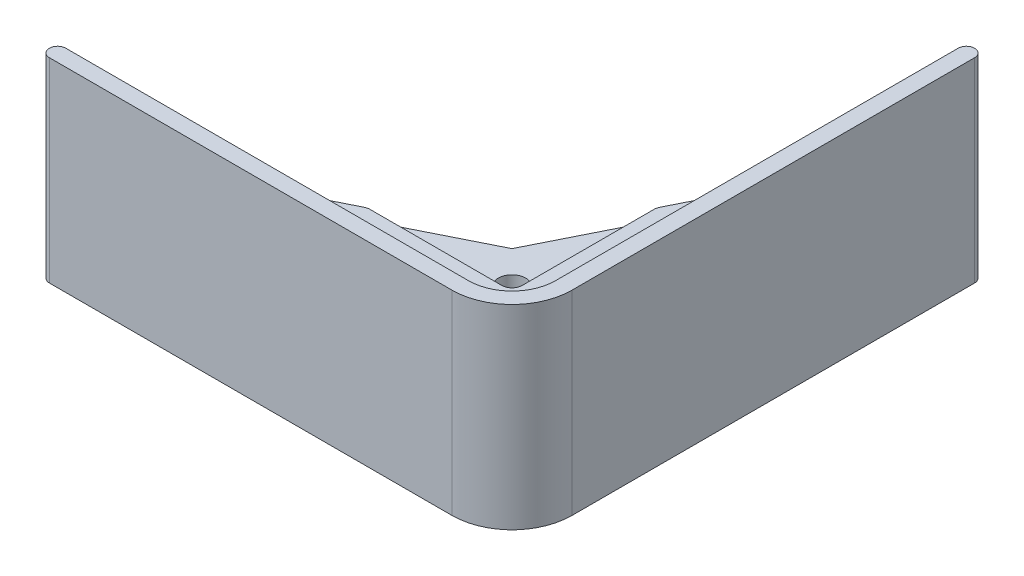
ISO-10303-21;
HEADER;
FILE_DESCRIPTION(('STEP AP214'),'2;1');
FILE_NAME('part.step','',(''),(''),'','','');
FILE_SCHEMA(('AUTOMOTIVE_DESIGN { 1 0 10303 214 1 1 1 1 }'));
ENDSEC;
DATA;
#1=APPLICATION_CONTEXT('core data for automotive mechanical design processes');
#2=APPLICATION_PROTOCOL_DEFINITION('international standard','automotive_design',2000,#1);
#3=PRODUCT_CONTEXT('',#1,'mechanical');
#4=PRODUCT('Part','Part','',(#3));
#5=PRODUCT_RELATED_PRODUCT_CATEGORY('part','',(#4));
#6=PRODUCT_DEFINITION_FORMATION('','',#4);
#7=PRODUCT_DEFINITION_CONTEXT('part definition',#1,'design');
#8=PRODUCT_DEFINITION('design','',#6,#7);
#9=PRODUCT_DEFINITION_SHAPE('','',#8);
#10=(LENGTH_UNIT() NAMED_UNIT(*) SI_UNIT(.MILLI.,.METRE.));
#11=(NAMED_UNIT(*) PLANE_ANGLE_UNIT() SI_UNIT($,.RADIAN.));
#12=(NAMED_UNIT(*) SI_UNIT($,.STERADIAN.) SOLID_ANGLE_UNIT());
#13=UNCERTAINTY_MEASURE_WITH_UNIT(LENGTH_MEASURE(1.E-05),#10,'distance_accuracy_value','');
#14=(GEOMETRIC_REPRESENTATION_CONTEXT(3) GLOBAL_UNCERTAINTY_ASSIGNED_CONTEXT((#13)) GLOBAL_UNIT_ASSIGNED_CONTEXT((#10,
#11,#12)) REPRESENTATION_CONTEXT('',''));
#15=CARTESIAN_POINT('',(0.,0.,0.));
#16=DIRECTION('',(0.,0.,1.));
#17=DIRECTION('',(1.,0.,0.));
#18=AXIS2_PLACEMENT_3D('',#15,#16,#17);
#19=CARTESIAN_POINT('',(0.,50.8,0.));
#20=DIRECTION('',(0.,-1.,0.));
#21=DIRECTION('',(0.,0.,-1.));
#22=AXIS2_PLACEMENT_3D('',#19,#20,#21);
#23=CYLINDRICAL_SURFACE('',#22,4.28625);
#24=CARTESIAN_POINT('',(0.,0.,0.));
#25=DIRECTION('',(0.,1.,0.));
#26=DIRECTION('',(0.,0.,1.));
#27=AXIS2_PLACEMENT_3D('',#24,#25,#26);
#28=CIRCLE('',#27,4.28625);
#29=CARTESIAN_POINT('',(0.,0.,4.28625));
#30=VERTEX_POINT('',#29);
#31=EDGE_CURVE('E273',#30,#30,#28,.T.);
#32=ORIENTED_EDGE('',*,*,#31,.F.);
#33=EDGE_LOOP('',(#32));
#34=FACE_BOUND('',#33,.T.);
#35=CARTESIAN_POINT('',(0.,47.371,0.));
#36=DIRECTION('',(0.,1.,0.));
#37=DIRECTION('',(0.,0.,1.));
#38=AXIS2_PLACEMENT_3D('',#35,#36,#37);
#39=CIRCLE('',#38,4.28625);
#40=CARTESIAN_POINT('',(0.,47.371,4.28625));
#41=VERTEX_POINT('',#40);
#42=EDGE_CURVE('E259',#41,#41,#39,.T.);
#43=ORIENTED_EDGE('',*,*,#42,.T.);
#44=EDGE_LOOP('',(#43));
#45=FACE_BOUND('',#44,.T.);
#46=ADVANCED_FACE('F39',(#34,#45),#23,.F.);
#47=CARTESIAN_POINT('',(-12.0476063758865,50.8,-6.00671496008418));
#48=DIRECTION('',(-0.894934361602028,0.,-0.446197813109804));
#49=DIRECTION('',(-0.446197813109804,0.,0.894934361602028));
#50=AXIS2_PLACEMENT_3D('',#47,#48,#49);
#51=PLANE('',#50);
#52=DIRECTION('',(0.446197813109804,0.,-0.894934361602028));
#53=VECTOR('',#52,1.);
#54=CARTESIAN_POINT('',(-12.0476063758865,47.371,-6.00671496008418));
#55=LINE('',#54,#53);
#56=CARTESIAN_POINT('',(-10.0377876646592,47.371,-10.0377876646592));
#57=VERTEX_POINT('',#56);
#58=CARTESIAN_POINT('',(5.15958340191356,47.371,-40.5189984054781));
#59=VERTEX_POINT('',#58);
#60=EDGE_CURVE('E266',#57,#59,#55,.T.);
#61=ORIENTED_EDGE('',*,*,#60,.T.);
#62=DIRECTION('',(0.,1.,0.));
#63=VECTOR('',#62,1.);
#64=CARTESIAN_POINT('',(5.15958340191356,50.8,-40.5189984054781));
#65=LINE('',#64,#63);
#66=CARTESIAN_POINT('',(5.15958340191356,50.8,-40.5189984054781));
#67=VERTEX_POINT('',#66);
#68=EDGE_CURVE('E297',#59,#67,#65,.T.);
#69=ORIENTED_EDGE('',*,*,#68,.T.);
#70=DIRECTION('',(0.446197813109804,0.,-0.894934361602028));
#71=VECTOR('',#70,1.);
#72=CARTESIAN_POINT('',(-12.0476063758865,50.8,-6.00671496008418));
#73=LINE('',#72,#71);
#74=CARTESIAN_POINT('',(13.462,50.8,-57.1710699299391));
#75=VERTEX_POINT('',#74);
#76=EDGE_CURVE('E269',#67,#75,#73,.T.);
#77=ORIENTED_EDGE('',*,*,#76,.T.);
#78=DIRECTION('',(0.,-1.,0.));
#79=VECTOR('',#78,1.);
#80=CARTESIAN_POINT('',(13.462,50.8,-57.1710699299391));
#81=LINE('',#80,#79);
#82=CARTESIAN_POINT('',(13.462,0.,-57.1710699299391));
#83=VERTEX_POINT('',#82);
#84=EDGE_CURVE('E275',#75,#83,#81,.T.);
#85=ORIENTED_EDGE('',*,*,#84,.T.);
#86=DIRECTION('',(0.446197813109804,0.,-0.894934361602028));
#87=VECTOR('',#86,1.);
#88=CARTESIAN_POINT('',(-12.0476063758865,0.,-6.00671496008418));
#89=LINE('',#88,#87);
#90=CARTESIAN_POINT('',(-10.0377876646592,0.,-10.0377876646592));
#91=VERTEX_POINT('',#90);
#92=EDGE_CURVE('E268',#91,#83,#89,.T.);
#93=ORIENTED_EDGE('',*,*,#92,.F.);
#94=DIRECTION('',(0.,-1.,0.));
#95=VECTOR('',#94,1.);
#96=CARTESIAN_POINT('',(-10.0377876646592,50.8,-10.0377876646592));
#97=LINE('',#96,#95);
#98=EDGE_CURVE('E287',#57,#91,#97,.T.);
#99=ORIENTED_EDGE('',*,*,#98,.F.);
#100=EDGE_LOOP('',(#61,#69,#77,#85,#93,#99));
#101=FACE_BOUND('',#100,.T.);
#102=ADVANCED_FACE('F354',(#101),#51,.T.);
#103=CARTESIAN_POINT('',(-6.00671496008417,50.8,-12.0476063758865));
#104=DIRECTION('',(0.446197813109803,0.,0.894934361602028));
#105=DIRECTION('',(0.894934361602028,0.,-0.446197813109804));
#106=AXIS2_PLACEMENT_3D('',#103,#104,#105);
#107=PLANE('',#106);
#108=DIRECTION('',(-0.894934361602028,0.,0.446197813109804));
#109=VECTOR('',#108,1.);
#110=CARTESIAN_POINT('',(-6.00671496008417,50.8,-12.0476063758865));
#111=LINE('',#110,#109);
#112=CARTESIAN_POINT('',(-40.5189984054781,50.8,5.15958340191357));
#113=VERTEX_POINT('',#112);
#114=CARTESIAN_POINT('',(-57.1710699299391,50.8,13.462));
#115=VERTEX_POINT('',#114);
#116=EDGE_CURVE('E272',#113,#115,#111,.T.);
#117=ORIENTED_EDGE('',*,*,#116,.F.);
#118=DIRECTION('',(0.,1.,0.));
#119=VECTOR('',#118,1.);
#120=CARTESIAN_POINT('',(-40.5189984054781,50.8,5.15958340191357));
#121=LINE('',#120,#119);
#122=CARTESIAN_POINT('',(-40.5189984054781,47.371,5.15958340191357));
#123=VERTEX_POINT('',#122);
#124=EDGE_CURVE('E318',#113,#123,#121,.F.);
#125=ORIENTED_EDGE('',*,*,#124,.T.);
#126=DIRECTION('',(-0.894934361602028,0.,0.446197813109804));
#127=VECTOR('',#126,1.);
#128=CARTESIAN_POINT('',(-6.00671496008417,47.371,-12.0476063758865));
#129=LINE('',#128,#127);
#130=EDGE_CURVE('E264',#57,#123,#129,.T.);
#131=ORIENTED_EDGE('',*,*,#130,.F.);
#132=ORIENTED_EDGE('',*,*,#98,.T.);
#133=DIRECTION('',(-0.894934361602028,0.,0.446197813109804));
#134=VECTOR('',#133,1.);
#135=CARTESIAN_POINT('',(-6.00671496008417,0.,-12.0476063758865));
#136=LINE('',#135,#134);
#137=CARTESIAN_POINT('',(-57.1710699299391,0.,13.462));
#138=VERTEX_POINT('',#137);
#139=EDGE_CURVE('E277',#91,#138,#136,.T.);
#140=ORIENTED_EDGE('',*,*,#139,.T.);
#141=DIRECTION('',(0.,-1.,0.));
#142=VECTOR('',#141,1.);
#143=CARTESIAN_POINT('',(-57.1710699299391,50.8,13.462));
#144=LINE('',#143,#142);
#145=EDGE_CURVE('E174',#115,#138,#144,.T.);
#146=ORIENTED_EDGE('',*,*,#145,.F.);
#147=EDGE_LOOP('',(#117,#125,#131,#132,#140,#146));
#148=FACE_BOUND('',#147,.T.);
#149=ADVANCED_FACE('F350',(#148),#107,.F.);
#150=CARTESIAN_POINT('',(0.,50.8,13.462));
#151=DIRECTION('',(0.,0.,-1.));
#152=DIRECTION('',(-1.,0.,0.));
#153=AXIS2_PLACEMENT_3D('',#150,#151,#152);
#154=PLANE('',#153);
#155=ORIENTED_EDGE('',*,*,#145,.T.);
#156=DIRECTION('',(1.,0.,0.));
#157=VECTOR('',#156,1.);
#158=CARTESIAN_POINT('',(0.,0.,13.462));
#159=LINE('',#158,#157);
#160=CARTESIAN_POINT('',(7.11200000000001,0.,13.462));
#161=VERTEX_POINT('',#160);
#162=EDGE_CURVE('E167',#138,#161,#159,.T.);
#163=ORIENTED_EDGE('',*,*,#162,.T.);
#164=DIRECTION('',(0.,-1.,0.));
#165=VECTOR('',#164,1.);
#166=CARTESIAN_POINT('',(7.11200000000001,0.,13.462));
#167=LINE('',#166,#165);
#168=CARTESIAN_POINT('',(7.11200000000001,-4.7625,13.462));
#169=VERTEX_POINT('',#168);
#170=EDGE_CURVE('E171',#161,#169,#167,.T.);
#171=ORIENTED_EDGE('',*,*,#170,.T.);
#172=DIRECTION('',(-1.,0.,0.));
#173=VECTOR('',#172,1.);
#174=CARTESIAN_POINT('',(0.,-4.7625,13.462));
#175=LINE('',#174,#173);
#176=CARTESIAN_POINT('',(-124.46,-4.7625,13.462));
#177=VERTEX_POINT('',#176);
#178=EDGE_CURVE('E238',#169,#177,#175,.T.);
#179=ORIENTED_EDGE('',*,*,#178,.T.);
#180=DIRECTION('',(0.,-1.,0.));
#181=VECTOR('',#180,1.);
#182=CARTESIAN_POINT('',(-124.46,50.8,13.462));
#183=LINE('',#182,#181);
#184=CARTESIAN_POINT('',(-124.46,55.5625,13.462));
#185=VERTEX_POINT('',#184);
#186=EDGE_CURVE('E293',#177,#185,#183,.F.);
#187=ORIENTED_EDGE('',*,*,#186,.T.);
#188=DIRECTION('',(-1.,0.,0.));
#189=VECTOR('',#188,1.);
#190=CARTESIAN_POINT('',(0.,55.5625,13.462));
#191=LINE('',#190,#189);
#192=CARTESIAN_POINT('',(0.,55.5625,13.462));
#193=VERTEX_POINT('',#192);
#194=EDGE_CURVE('E221',#193,#185,#191,.T.);
#195=ORIENTED_EDGE('',*,*,#194,.F.);
#196=DIRECTION('',(0.,-1.,0.));
#197=VECTOR('',#196,1.);
#198=CARTESIAN_POINT('',(0.,55.5625,13.462));
#199=LINE('',#198,#197);
#200=CARTESIAN_POINT('',(0.,50.8,13.462));
#201=VERTEX_POINT('',#200);
#202=EDGE_CURVE('E224',#193,#201,#199,.T.);
#203=ORIENTED_EDGE('',*,*,#202,.T.);
#204=DIRECTION('',(1.,0.,0.));
#205=VECTOR('',#204,1.);
#206=CARTESIAN_POINT('',(0.,50.8,13.462));
#207=LINE('',#206,#205);
#208=EDGE_CURVE('E59',#115,#201,#207,.T.);
#209=ORIENTED_EDGE('',*,*,#208,.F.);
#210=EDGE_LOOP('',(#155,#163,#171,#179,#187,#195,#203,#209));
#211=FACE_BOUND('',#210,.T.);
#212=ADVANCED_FACE('F169',(#211),#154,.T.);
#213=CARTESIAN_POINT('',(0.,50.8,18.542));
#214=DIRECTION('',(0.,0.,1.));
#215=DIRECTION('',(1.,0.,0.));
#216=AXIS2_PLACEMENT_3D('',#213,#214,#215);
#217=PLANE('',#216);
#218=DIRECTION('',(0.,-1.,0.));
#219=VECTOR('',#218,1.);
#220=CARTESIAN_POINT('',(0.,50.8,18.542));
#221=LINE('',#220,#219);
#222=CARTESIAN_POINT('',(0.,55.5625,18.542));
#223=VERTEX_POINT('',#222);
#224=CARTESIAN_POINT('',(0.,-4.7625,18.542));
#225=VERTEX_POINT('',#224);
#226=EDGE_CURVE('E284',#223,#225,#221,.T.);
#227=ORIENTED_EDGE('',*,*,#226,.F.);
#228=DIRECTION('',(1.,0.,0.));
#229=VECTOR('',#228,1.);
#230=CARTESIAN_POINT('',(-124.46,55.5625,18.542));
#231=LINE('',#230,#229);
#232=CARTESIAN_POINT('',(-124.46,55.5625,18.542));
#233=VERTEX_POINT('',#232);
#234=EDGE_CURVE('E204',#233,#223,#231,.T.);
#235=ORIENTED_EDGE('',*,*,#234,.F.);
#236=DIRECTION('',(0.,-1.,0.));
#237=VECTOR('',#236,1.);
#238=CARTESIAN_POINT('',(-124.46,50.8,18.542));
#239=LINE('',#238,#237);
#240=CARTESIAN_POINT('',(-124.46,-4.7625,18.542));
#241=VERTEX_POINT('',#240);
#242=EDGE_CURVE('E295',#233,#241,#239,.T.);
#243=ORIENTED_EDGE('',*,*,#242,.T.);
#244=DIRECTION('',(1.,0.,0.));
#245=VECTOR('',#244,1.);
#246=CARTESIAN_POINT('',(-124.46,-4.7625,18.542));
#247=LINE('',#246,#245);
#248=EDGE_CURVE('E199',#241,#225,#247,.T.);
#249=ORIENTED_EDGE('',*,*,#248,.T.);
#250=EDGE_LOOP('',(#227,#235,#243,#249));
#251=FACE_BOUND('',#250,.T.);
#252=ADVANCED_FACE('F390',(#251),#217,.T.);
#253=CARTESIAN_POINT('',(0.,50.8,0.));
#254=DIRECTION('',(0.,-1.,0.));
#255=DIRECTION('',(0.,0.,-1.));
#256=AXIS2_PLACEMENT_3D('',#253,#254,#255);
#257=CYLINDRICAL_SURFACE('',#256,18.542);
#258=ORIENTED_EDGE('',*,*,#226,.T.);
#259=CARTESIAN_POINT('',(0.,-4.7625,0.));
#260=DIRECTION('',(0.,1.,0.));
#261=DIRECTION('',(0.,0.,1.));
#262=AXIS2_PLACEMENT_3D('',#259,#260,#261);
#263=CIRCLE('',#262,18.542);
#264=CARTESIAN_POINT('',(18.542,-4.7625,0.));
#265=VERTEX_POINT('',#264);
#266=EDGE_CURVE('E227',#225,#265,#263,.T.);
#267=ORIENTED_EDGE('',*,*,#266,.T.);
#268=DIRECTION('',(0.,-1.,0.));
#269=VECTOR('',#268,1.);
#270=CARTESIAN_POINT('',(18.542,50.8,0.));
#271=LINE('',#270,#269);
#272=CARTESIAN_POINT('',(18.542,55.5625,0.));
#273=VERTEX_POINT('',#272);
#274=EDGE_CURVE('E282',#273,#265,#271,.T.);
#275=ORIENTED_EDGE('',*,*,#274,.F.);
#276=CARTESIAN_POINT('',(0.,55.5625,0.));
#277=DIRECTION('',(0.,1.,0.));
#278=DIRECTION('',(0.,0.,1.));
#279=AXIS2_PLACEMENT_3D('',#276,#277,#278);
#280=CIRCLE('',#279,18.542);
#281=EDGE_CURVE('E208',#223,#273,#280,.T.);
#282=ORIENTED_EDGE('',*,*,#281,.F.);
#283=EDGE_LOOP('',(#258,#267,#275,#282));
#284=FACE_BOUND('',#283,.T.);
#285=ADVANCED_FACE('F388',(#284),#257,.T.);
#286=CARTESIAN_POINT('',(18.542,50.8,0.));
#287=DIRECTION('',(-1.,0.,0.));
#288=DIRECTION('',(0.,0.,1.));
#289=AXIS2_PLACEMENT_3D('',#286,#287,#288);
#290=PLANE('',#289);
#291=ORIENTED_EDGE('',*,*,#274,.T.);
#292=DIRECTION('',(0.,0.,-1.));
#293=VECTOR('',#292,1.);
#294=CARTESIAN_POINT('',(18.542,-4.7625,0.));
#295=LINE('',#294,#293);
#296=CARTESIAN_POINT('',(18.542,-4.7625,-124.46));
#297=VERTEX_POINT('',#296);
#298=EDGE_CURVE('E230',#265,#297,#295,.T.);
#299=ORIENTED_EDGE('',*,*,#298,.T.);
#300=DIRECTION('',(0.,-1.,0.));
#301=VECTOR('',#300,1.);
#302=CARTESIAN_POINT('',(18.542,50.8,-124.46));
#303=LINE('',#302,#301);
#304=CARTESIAN_POINT('',(18.542,55.5625,-124.46));
#305=VERTEX_POINT('',#304);
#306=EDGE_CURVE('E291',#297,#305,#303,.F.);
#307=ORIENTED_EDGE('',*,*,#306,.T.);
#308=DIRECTION('',(0.,0.,-1.));
#309=VECTOR('',#308,1.);
#310=CARTESIAN_POINT('',(18.542,55.5625,0.));
#311=LINE('',#310,#309);
#312=EDGE_CURVE('E211',#273,#305,#311,.T.);
#313=ORIENTED_EDGE('',*,*,#312,.F.);
#314=EDGE_LOOP('',(#291,#299,#307,#313));
#315=FACE_BOUND('',#314,.T.);
#316=ADVANCED_FACE('F384',(#315),#290,.F.);
#317=CARTESIAN_POINT('',(13.462,50.8,0.));
#318=DIRECTION('',(-1.,0.,0.));
#319=DIRECTION('',(0.,0.,1.));
#320=AXIS2_PLACEMENT_3D('',#317,#318,#319);
#321=PLANE('',#320);
#322=ORIENTED_EDGE('',*,*,#84,.F.);
#323=DIRECTION('',(0.,0.,-1.));
#324=VECTOR('',#323,1.);
#325=CARTESIAN_POINT('',(13.462,50.8,0.));
#326=LINE('',#325,#324);
#327=CARTESIAN_POINT('',(13.462,50.8,0.));
#328=VERTEX_POINT('',#327);
#329=EDGE_CURVE('E248',#328,#75,#326,.T.);
#330=ORIENTED_EDGE('',*,*,#329,.F.);
#331=DIRECTION('',(0.,-1.,0.));
#332=VECTOR('',#331,1.);
#333=CARTESIAN_POINT('',(13.462,55.5625,0.));
#334=LINE('',#333,#332);
#335=CARTESIAN_POINT('',(13.462,55.5625,0.));
#336=VERTEX_POINT('',#335);
#337=EDGE_CURVE('E179',#336,#328,#334,.T.);
#338=ORIENTED_EDGE('',*,*,#337,.F.);
#339=DIRECTION('',(0.,0.,1.));
#340=VECTOR('',#339,1.);
#341=CARTESIAN_POINT('',(13.462,55.5625,-124.46));
#342=LINE('',#341,#340);
#343=CARTESIAN_POINT('',(13.462,55.5625,-124.46));
#344=VERTEX_POINT('',#343);
#345=EDGE_CURVE('E217',#344,#336,#342,.T.);
#346=ORIENTED_EDGE('',*,*,#345,.F.);
#347=DIRECTION('',(0.,-1.,0.));
#348=VECTOR('',#347,1.);
#349=CARTESIAN_POINT('',(13.462,50.8,-124.46));
#350=LINE('',#349,#348);
#351=CARTESIAN_POINT('',(13.462,-4.7625,-124.46));
#352=VERTEX_POINT('',#351);
#353=EDGE_CURVE('E289',#344,#352,#350,.T.);
#354=ORIENTED_EDGE('',*,*,#353,.T.);
#355=DIRECTION('',(0.,0.,1.));
#356=VECTOR('',#355,1.);
#357=CARTESIAN_POINT('',(13.462,-4.7625,-124.46));
#358=LINE('',#357,#356);
#359=CARTESIAN_POINT('',(13.462,-4.7625,7.112));
#360=VERTEX_POINT('',#359);
#361=EDGE_CURVE('E236',#352,#360,#358,.T.);
#362=ORIENTED_EDGE('',*,*,#361,.T.);
#363=DIRECTION('',(0.,-1.,0.));
#364=VECTOR('',#363,1.);
#365=CARTESIAN_POINT('',(13.462,0.,7.112));
#366=LINE('',#365,#364);
#367=CARTESIAN_POINT('',(13.462,0.,7.112));
#368=VERTEX_POINT('',#367);
#369=EDGE_CURVE('E189',#368,#360,#366,.T.);
#370=ORIENTED_EDGE('',*,*,#369,.F.);
#371=DIRECTION('',(0.,0.,-1.));
#372=VECTOR('',#371,1.);
#373=CARTESIAN_POINT('',(13.462,0.,0.));
#374=LINE('',#373,#372);
#375=EDGE_CURVE('E195',#368,#83,#374,.T.);
#376=ORIENTED_EDGE('',*,*,#375,.T.);
#377=EDGE_LOOP('',(#322,#330,#338,#346,#354,#362,#370,#376));
#378=FACE_BOUND('',#377,.T.);
#379=ADVANCED_FACE('F357',(#378),#321,.T.);
#380=CARTESIAN_POINT('',(0.,50.8,0.));
#381=DIRECTION('',(0.,1.,0.));
#382=DIRECTION('',(0.,0.,1.));
#383=AXIS2_PLACEMENT_3D('',#380,#381,#382);
#384=PLANE('',#383);
#385=CARTESIAN_POINT('',(0.,50.8,0.));
#386=DIRECTION('',(0.,1.,0.));
#387=DIRECTION('',(0.,0.,1.));
#388=AXIS2_PLACEMENT_3D('',#385,#386,#387);
#389=CIRCLE('',#388,13.462);
#390=EDGE_CURVE('E54',#201,#328,#389,.T.);
#391=ORIENTED_EDGE('',*,*,#390,.T.);
#392=ORIENTED_EDGE('',*,*,#329,.T.);
#393=ORIENTED_EDGE('',*,*,#76,.F.);
#394=CARTESIAN_POINT('',(8.001,50.8,-39.1023203488544));
#395=DIRECTION('',(0.,1.,0.));
#396=DIRECTION('',(0.,0.,1.));
#397=AXIS2_PLACEMENT_3D('',#394,#395,#396);
#398=CIRCLE('',#397,3.175);
#399=CARTESIAN_POINT('',(4.826,50.8,-39.1023203488544));
#400=VERTEX_POINT('',#399);
#401=EDGE_CURVE('E304',#67,#400,#398,.T.);
#402=ORIENTED_EDGE('',*,*,#401,.T.);
#403=DIRECTION('',(0.,0.,-1.));
#404=VECTOR('',#403,1.);
#405=CARTESIAN_POINT('',(4.826,50.8,4.826));
#406=LINE('',#405,#404);
#407=CARTESIAN_POINT('',(4.826,50.8,1.651));
#408=VERTEX_POINT('',#407);
#409=EDGE_CURVE('E251',#408,#400,#406,.T.);
#410=ORIENTED_EDGE('',*,*,#409,.F.);
#411=CARTESIAN_POINT('',(1.651,50.8,1.651));
#412=DIRECTION('',(0.,1.,0.));
#413=DIRECTION('',(0.,0.,1.));
#414=AXIS2_PLACEMENT_3D('',#411,#412,#413);
#415=CIRCLE('',#414,3.175);
#416=CARTESIAN_POINT('',(1.651,50.8,4.826));
#417=VERTEX_POINT('',#416);
#418=EDGE_CURVE('E47',#408,#417,#415,.F.);
#419=ORIENTED_EDGE('',*,*,#418,.T.);
#420=DIRECTION('',(1.,0.,0.));
#421=VECTOR('',#420,1.);
#422=CARTESIAN_POINT('',(4.826,50.8,4.826));
#423=LINE('',#422,#421);
#424=CARTESIAN_POINT('',(-39.1023203488544,50.8,4.826));
#425=VERTEX_POINT('',#424);
#426=EDGE_CURVE('E256',#425,#417,#423,.T.);
#427=ORIENTED_EDGE('',*,*,#426,.F.);
#428=CARTESIAN_POINT('',(-39.1023203488544,50.8,8.001));
#429=DIRECTION('',(0.,1.,0.));
#430=DIRECTION('',(0.,0.,1.));
#431=AXIS2_PLACEMENT_3D('',#428,#429,#430);
#432=CIRCLE('',#431,3.175);
#433=EDGE_CURVE('E302',#425,#113,#432,.T.);
#434=ORIENTED_EDGE('',*,*,#433,.T.);
#435=ORIENTED_EDGE('',*,*,#116,.T.);
#436=ORIENTED_EDGE('',*,*,#208,.T.);
#437=EDGE_LOOP('',(#391,#392,#393,#402,#410,#419,#427,#434,#435,#436));
#438=FACE_BOUND('',#437,.T.);
#439=ADVANCED_FACE('F325',(#438),#384,.T.);
#440=CARTESIAN_POINT('',(0.,0.,0.));
#441=DIRECTION('',(0.,1.,0.));
#442=DIRECTION('',(0.,0.,1.));
#443=AXIS2_PLACEMENT_3D('',#440,#441,#442);
#444=PLANE('',#443);
#445=ORIENTED_EDGE('',*,*,#375,.F.);
#446=CARTESIAN_POINT('',(7.11200000000001,0.,7.112));
#447=DIRECTION('',(0.,-1.,0.));
#448=DIRECTION('',(0.,0.,-1.));
#449=AXIS2_PLACEMENT_3D('',#446,#447,#448);
#450=CIRCLE('',#449,6.35);
#451=EDGE_CURVE('E185',#161,#368,#450,.F.);
#452=ORIENTED_EDGE('',*,*,#451,.F.);
#453=ORIENTED_EDGE('',*,*,#162,.F.);
#454=ORIENTED_EDGE('',*,*,#139,.F.);
#455=ORIENTED_EDGE('',*,*,#92,.T.);
#456=EDGE_LOOP('',(#445,#452,#453,#454,#455));
#457=FACE_BOUND('',#456,.T.);
#458=ORIENTED_EDGE('',*,*,#31,.T.);
#459=EDGE_LOOP('',(#458));
#460=FACE_BOUND('',#459,.T.);
#461=ADVANCED_FACE('F191',(#457,#460),#444,.F.);
#462=CARTESIAN_POINT('',(16.002,50.8,-124.46));
#463=DIRECTION('',(0.,1.,0.));
#464=DIRECTION('',(0.,0.,1.));
#465=AXIS2_PLACEMENT_3D('',#462,#463,#464);
#466=CYLINDRICAL_SURFACE('',#465,2.54);
#467=ORIENTED_EDGE('',*,*,#353,.F.);
#468=CARTESIAN_POINT('',(16.002,55.5625,-124.46));
#469=DIRECTION('',(0.,1.,0.));
#470=DIRECTION('',(0.,0.,1.));
#471=AXIS2_PLACEMENT_3D('',#468,#469,#470);
#472=CIRCLE('',#471,2.54);
#473=EDGE_CURVE('E214',#305,#344,#472,.T.);
#474=ORIENTED_EDGE('',*,*,#473,.F.);
#475=ORIENTED_EDGE('',*,*,#306,.F.);
#476=CARTESIAN_POINT('',(16.002,-4.7625,-124.46));
#477=DIRECTION('',(0.,1.,0.));
#478=DIRECTION('',(0.,0.,1.));
#479=AXIS2_PLACEMENT_3D('',#476,#477,#478);
#480=CIRCLE('',#479,2.54);
#481=EDGE_CURVE('E233',#297,#352,#480,.T.);
#482=ORIENTED_EDGE('',*,*,#481,.T.);
#483=EDGE_LOOP('',(#467,#474,#475,#482));
#484=FACE_BOUND('',#483,.T.);
#485=ADVANCED_FACE('F380',(#484),#466,.T.);
#486=CARTESIAN_POINT('',(-124.46,50.8,16.002));
#487=DIRECTION('',(0.,-1.,0.));
#488=DIRECTION('',(0.,0.,-1.));
#489=AXIS2_PLACEMENT_3D('',#486,#487,#488);
#490=CYLINDRICAL_SURFACE('',#489,2.54);
#491=ORIENTED_EDGE('',*,*,#242,.F.);
#492=CARTESIAN_POINT('',(-124.46,55.5625,16.002));
#493=DIRECTION('',(0.,1.,0.));
#494=DIRECTION('',(0.,0.,1.));
#495=AXIS2_PLACEMENT_3D('',#492,#493,#494);
#496=CIRCLE('',#495,2.54);
#497=EDGE_CURVE('E201',#185,#233,#496,.T.);
#498=ORIENTED_EDGE('',*,*,#497,.F.);
#499=ORIENTED_EDGE('',*,*,#186,.F.);
#500=CARTESIAN_POINT('',(-124.46,-4.7625,16.002));
#501=DIRECTION('',(0.,1.,0.));
#502=DIRECTION('',(0.,0.,1.));
#503=AXIS2_PLACEMENT_3D('',#500,#501,#502);
#504=CIRCLE('',#503,2.54);
#505=EDGE_CURVE('E205',#177,#241,#504,.T.);
#506=ORIENTED_EDGE('',*,*,#505,.T.);
#507=EDGE_LOOP('',(#491,#498,#499,#506));
#508=FACE_BOUND('',#507,.T.);
#509=ADVANCED_FACE('F367',(#508),#490,.T.);
#510=CARTESIAN_POINT('',(4.826,47.371,4.826));
#511=DIRECTION('',(1.,0.,0.));
#512=DIRECTION('',(0.,0.,-1.));
#513=AXIS2_PLACEMENT_3D('',#510,#511,#512);
#514=PLANE('',#513);
#515=ORIENTED_EDGE('',*,*,#409,.T.);
#516=DIRECTION('',(0.,1.,0.));
#517=VECTOR('',#516,1.);
#518=CARTESIAN_POINT('',(4.826,47.371,-39.1023203488544));
#519=LINE('',#518,#517);
#520=CARTESIAN_POINT('',(4.826,47.371,-39.1023203488544));
#521=VERTEX_POINT('',#520);
#522=EDGE_CURVE('E309',#400,#521,#519,.F.);
#523=ORIENTED_EDGE('',*,*,#522,.T.);
#524=DIRECTION('',(0.,0.,-1.));
#525=VECTOR('',#524,1.);
#526=CARTESIAN_POINT('',(4.826,47.371,4.826));
#527=LINE('',#526,#525);
#528=CARTESIAN_POINT('',(4.826,47.371,1.651));
#529=VERTEX_POINT('',#528);
#530=EDGE_CURVE('E252',#529,#521,#527,.T.);
#531=ORIENTED_EDGE('',*,*,#530,.F.);
#532=DIRECTION('',(0.,1.,0.));
#533=VECTOR('',#532,1.);
#534=CARTESIAN_POINT('',(4.826,50.8,1.651));
#535=LINE('',#534,#533);
#536=EDGE_CURVE('E306',#529,#408,#535,.T.);
#537=ORIENTED_EDGE('',*,*,#536,.T.);
#538=EDGE_LOOP('',(#515,#523,#531,#537));
#539=FACE_BOUND('',#538,.T.);
#540=ADVANCED_FACE('F340',(#539),#514,.F.);
#541=CARTESIAN_POINT('',(4.826,47.371,4.826));
#542=DIRECTION('',(0.,0.,1.));
#543=DIRECTION('',(1.,0.,0.));
#544=AXIS2_PLACEMENT_3D('',#541,#542,#543);
#545=PLANE('',#544);
#546=ORIENTED_EDGE('',*,*,#426,.T.);
#547=DIRECTION('',(0.,1.,0.));
#548=VECTOR('',#547,1.);
#549=CARTESIAN_POINT('',(1.651,47.371,4.826));
#550=LINE('',#549,#548);
#551=CARTESIAN_POINT('',(1.651,47.371,4.826));
#552=VERTEX_POINT('',#551);
#553=EDGE_CURVE('E314',#417,#552,#550,.F.);
#554=ORIENTED_EDGE('',*,*,#553,.T.);
#555=DIRECTION('',(1.,0.,0.));
#556=VECTOR('',#555,1.);
#557=CARTESIAN_POINT('',(4.826,47.371,4.826));
#558=LINE('',#557,#556);
#559=CARTESIAN_POINT('',(-39.1023203488544,47.371,4.826));
#560=VERTEX_POINT('',#559);
#561=EDGE_CURVE('E255',#560,#552,#558,.T.);
#562=ORIENTED_EDGE('',*,*,#561,.F.);
#563=DIRECTION('',(0.,1.,0.));
#564=VECTOR('',#563,1.);
#565=CARTESIAN_POINT('',(-39.1023203488544,47.371,4.826));
#566=LINE('',#565,#564);
#567=EDGE_CURVE('E311',#560,#425,#566,.T.);
#568=ORIENTED_EDGE('',*,*,#567,.T.);
#569=EDGE_LOOP('',(#546,#554,#562,#568));
#570=FACE_BOUND('',#569,.T.);
#571=ADVANCED_FACE('F330',(#570),#545,.F.);
#572=CARTESIAN_POINT('',(0.,47.371,0.));
#573=DIRECTION('',(0.,1.,0.));
#574=DIRECTION('',(0.,0.,1.));
#575=AXIS2_PLACEMENT_3D('',#572,#573,#574);
#576=PLANE('',#575);
#577=ORIENTED_EDGE('',*,*,#42,.F.);
#578=EDGE_LOOP('',(#577));
#579=FACE_BOUND('',#578,.T.);
#580=ORIENTED_EDGE('',*,*,#561,.T.);
#581=CARTESIAN_POINT('',(1.651,47.371,1.651));
#582=DIRECTION('',(0.,1.,0.));
#583=DIRECTION('',(0.,0.,1.));
#584=AXIS2_PLACEMENT_3D('',#581,#582,#583);
#585=CIRCLE('',#584,3.175);
#586=EDGE_CURVE('E316',#552,#529,#585,.T.);
#587=ORIENTED_EDGE('',*,*,#586,.T.);
#588=ORIENTED_EDGE('',*,*,#530,.T.);
#589=CARTESIAN_POINT('',(8.001,47.371,-39.1023203488544));
#590=DIRECTION('',(0.,1.,0.));
#591=DIRECTION('',(0.,0.,1.));
#592=AXIS2_PLACEMENT_3D('',#589,#590,#591);
#593=CIRCLE('',#592,3.175);
#594=EDGE_CURVE('E321',#521,#59,#593,.F.);
#595=ORIENTED_EDGE('',*,*,#594,.T.);
#596=ORIENTED_EDGE('',*,*,#60,.F.);
#597=ORIENTED_EDGE('',*,*,#130,.T.);
#598=CARTESIAN_POINT('',(-39.1023203488544,47.371,8.001));
#599=DIRECTION('',(0.,1.,0.));
#600=DIRECTION('',(0.,0.,1.));
#601=AXIS2_PLACEMENT_3D('',#598,#599,#600);
#602=CIRCLE('',#601,3.175);
#603=EDGE_CURVE('E11',#123,#560,#602,.F.);
#604=ORIENTED_EDGE('',*,*,#603,.T.);
#605=EDGE_LOOP('',(#580,#587,#588,#595,#596,#597,#604));
#606=FACE_BOUND('',#605,.T.);
#607=ADVANCED_FACE('F337',(#579,#606),#576,.T.);
#608=CARTESIAN_POINT('',(8.001,50.8,-39.1023203488544));
#609=DIRECTION('',(0.,-1.,0.));
#610=DIRECTION('',(0.,0.,-1.));
#611=AXIS2_PLACEMENT_3D('',#608,#609,#610);
#612=CYLINDRICAL_SURFACE('',#611,3.175);
#613=ORIENTED_EDGE('',*,*,#594,.F.);
#614=ORIENTED_EDGE('',*,*,#522,.F.);
#615=ORIENTED_EDGE('',*,*,#401,.F.);
#616=ORIENTED_EDGE('',*,*,#68,.F.);
#617=EDGE_LOOP('',(#613,#614,#615,#616));
#618=FACE_BOUND('',#617,.T.);
#619=ADVANCED_FACE('F343',(#618),#612,.T.);
#620=CARTESIAN_POINT('',(1.651,47.371,1.651));
#621=DIRECTION('',(0.,-1.,0.));
#622=DIRECTION('',(0.,0.,-1.));
#623=AXIS2_PLACEMENT_3D('',#620,#621,#622);
#624=CYLINDRICAL_SURFACE('',#623,3.175);
#625=ORIENTED_EDGE('',*,*,#586,.F.);
#626=ORIENTED_EDGE('',*,*,#553,.F.);
#627=ORIENTED_EDGE('',*,*,#418,.F.);
#628=ORIENTED_EDGE('',*,*,#536,.F.);
#629=EDGE_LOOP('',(#625,#626,#627,#628));
#630=FACE_BOUND('',#629,.T.);
#631=ADVANCED_FACE('F334',(#630),#624,.F.);
#632=CARTESIAN_POINT('',(-39.1023203488544,47.371,8.001));
#633=DIRECTION('',(0.,1.,0.));
#634=DIRECTION('',(0.,0.,1.));
#635=AXIS2_PLACEMENT_3D('',#632,#633,#634);
#636=CYLINDRICAL_SURFACE('',#635,3.175);
#637=ORIENTED_EDGE('',*,*,#603,.F.);
#638=ORIENTED_EDGE('',*,*,#124,.F.);
#639=ORIENTED_EDGE('',*,*,#433,.F.);
#640=ORIENTED_EDGE('',*,*,#567,.F.);
#641=EDGE_LOOP('',(#637,#638,#639,#640));
#642=FACE_BOUND('',#641,.T.);
#643=ADVANCED_FACE('F41',(#642),#636,.T.);
#644=CARTESIAN_POINT('',(-124.46,-4.7625,16.002));
#645=DIRECTION('',(0.,1.,0.));
#646=DIRECTION('',(0.,0.,1.));
#647=AXIS2_PLACEMENT_3D('',#644,#645,#646);
#648=PLANE('',#647);
#649=CARTESIAN_POINT('',(7.11200000000001,-4.7625,7.112));
#650=DIRECTION('',(0.,-1.,0.));
#651=DIRECTION('',(0.,0.,-1.));
#652=AXIS2_PLACEMENT_3D('',#649,#650,#651);
#653=CIRCLE('',#652,6.35);
#654=EDGE_CURVE('E188',#169,#360,#653,.F.);
#655=ORIENTED_EDGE('',*,*,#654,.T.);
#656=ORIENTED_EDGE('',*,*,#361,.F.);
#657=ORIENTED_EDGE('',*,*,#481,.F.);
#658=ORIENTED_EDGE('',*,*,#298,.F.);
#659=ORIENTED_EDGE('',*,*,#266,.F.);
#660=ORIENTED_EDGE('',*,*,#248,.F.);
#661=ORIENTED_EDGE('',*,*,#505,.F.);
#662=ORIENTED_EDGE('',*,*,#178,.F.);
#663=EDGE_LOOP('',(#655,#656,#657,#658,#659,#660,#661,#662));
#664=FACE_BOUND('',#663,.T.);
#665=ADVANCED_FACE('F360',(#664),#648,.F.);
#666=CARTESIAN_POINT('',(0.,55.5625,0.));
#667=DIRECTION('',(0.,-1.,0.));
#668=DIRECTION('',(0.,0.,-1.));
#669=AXIS2_PLACEMENT_3D('',#666,#667,#668);
#670=CYLINDRICAL_SURFACE('',#669,13.462);
#671=ORIENTED_EDGE('',*,*,#390,.F.);
#672=ORIENTED_EDGE('',*,*,#202,.F.);
#673=CARTESIAN_POINT('',(0.,55.5625,0.));
#674=DIRECTION('',(0.,-1.,0.));
#675=DIRECTION('',(0.,0.,1.));
#676=AXIS2_PLACEMENT_3D('',#673,#674,#675);
#677=CIRCLE('',#676,13.462);
#678=EDGE_CURVE('E219',#336,#193,#677,.T.);
#679=ORIENTED_EDGE('',*,*,#678,.F.);
#680=ORIENTED_EDGE('',*,*,#337,.T.);
#681=EDGE_LOOP('',(#671,#672,#679,#680));
#682=FACE_BOUND('',#681,.T.);
#683=ADVANCED_FACE('F376',(#682),#670,.F.);
#684=CARTESIAN_POINT('',(-124.46,55.5625,16.002));
#685=DIRECTION('',(0.,1.,0.));
#686=DIRECTION('',(0.,0.,1.));
#687=AXIS2_PLACEMENT_3D('',#684,#685,#686);
#688=PLANE('',#687);
#689=ORIENTED_EDGE('',*,*,#497,.T.);
#690=ORIENTED_EDGE('',*,*,#234,.T.);
#691=ORIENTED_EDGE('',*,*,#281,.T.);
#692=ORIENTED_EDGE('',*,*,#312,.T.);
#693=ORIENTED_EDGE('',*,*,#473,.T.);
#694=ORIENTED_EDGE('',*,*,#345,.T.);
#695=ORIENTED_EDGE('',*,*,#678,.T.);
#696=ORIENTED_EDGE('',*,*,#194,.T.);
#697=EDGE_LOOP('',(#689,#690,#691,#692,#693,#694,#695,#696));
#698=FACE_BOUND('',#697,.T.);
#699=ADVANCED_FACE('F370',(#698),#688,.T.);
#700=CARTESIAN_POINT('',(7.11200000000001,0.,7.112));
#701=DIRECTION('',(0.,-1.,0.));
#702=DIRECTION('',(0.,0.,-1.));
#703=AXIS2_PLACEMENT_3D('',#700,#701,#702);
#704=CYLINDRICAL_SURFACE('',#703,6.35);
#705=ORIENTED_EDGE('',*,*,#654,.F.);
#706=ORIENTED_EDGE('',*,*,#170,.F.);
#707=ORIENTED_EDGE('',*,*,#451,.T.);
#708=ORIENTED_EDGE('',*,*,#369,.T.);
#709=EDGE_LOOP('',(#705,#706,#707,#708));
#710=FACE_BOUND('',#709,.T.);
#711=ADVANCED_FACE('F183',(#710),#704,.F.);
#712=CLOSED_SHELL('',(#46,#102,#149,#212,#252,#285,#316,#379,#439,#461,#485,#509,#540,#571,#607,
#619,#631,#643,#665,#683,#699,#711));
#713=MANIFOLD_SOLID_BREP('B2',#712);
#714=ADVANCED_BREP_SHAPE_REPRESENTATION('',(#18,#713),#14);
#715=SHAPE_DEFINITION_REPRESENTATION(#9,#714);
ENDSEC;
END-ISO-10303-21;
